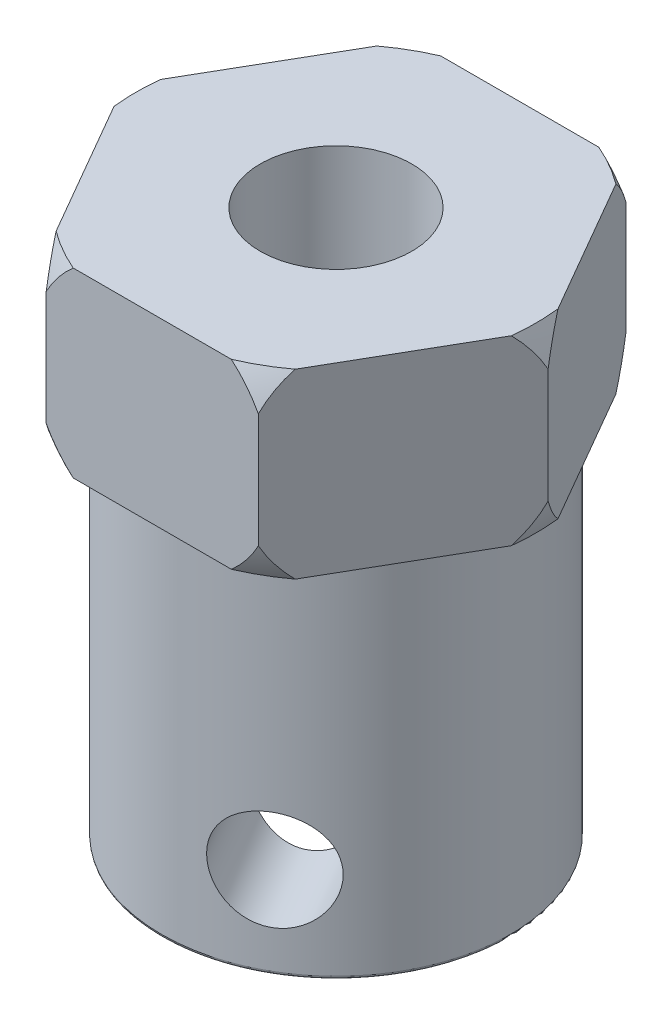
ISO-10303-21;
HEADER;
FILE_DESCRIPTION(('STEP AP214'),'2;1');
FILE_NAME('part.step','',(''),(''),'','','');
FILE_SCHEMA(('AUTOMOTIVE_DESIGN { 1 0 10303 214 1 1 1 1 }'));
ENDSEC;
DATA;
#1=APPLICATION_CONTEXT('core data for automotive mechanical design processes');
#2=APPLICATION_PROTOCOL_DEFINITION('international standard','automotive_design',2000,#1);
#3=PRODUCT_CONTEXT('',#1,'mechanical');
#4=PRODUCT('Part','Part','',(#3));
#5=PRODUCT_RELATED_PRODUCT_CATEGORY('part','',(#4));
#6=PRODUCT_DEFINITION_FORMATION('','',#4);
#7=PRODUCT_DEFINITION_CONTEXT('part definition',#1,'design');
#8=PRODUCT_DEFINITION('design','',#6,#7);
#9=PRODUCT_DEFINITION_SHAPE('','',#8);
#10=(LENGTH_UNIT() NAMED_UNIT(*) SI_UNIT(.MILLI.,.METRE.));
#11=(NAMED_UNIT(*) PLANE_ANGLE_UNIT() SI_UNIT($,.RADIAN.));
#12=(NAMED_UNIT(*) SI_UNIT($,.STERADIAN.) SOLID_ANGLE_UNIT());
#13=UNCERTAINTY_MEASURE_WITH_UNIT(LENGTH_MEASURE(1.E-05),#10,'distance_accuracy_value','');
#14=(GEOMETRIC_REPRESENTATION_CONTEXT(3) GLOBAL_UNCERTAINTY_ASSIGNED_CONTEXT((#13)) GLOBAL_UNIT_ASSIGNED_CONTEXT((#10,
#11,#12)) REPRESENTATION_CONTEXT('',''));
#15=CARTESIAN_POINT('',(0.,0.,0.));
#16=DIRECTION('',(0.,0.,1.));
#17=DIRECTION('',(1.,0.,0.));
#18=AXIS2_PLACEMENT_3D('',#15,#16,#17);
#19=CARTESIAN_POINT('',(-7.,6.,0.));
#20=DIRECTION('',(0.866025403784439,0.,-0.5));
#21=DIRECTION('',(-0.5,0.,-0.866025403784439));
#22=AXIS2_PLACEMENT_3D('',#19,#20,#21);
#23=PLANE('',#22);
#24=CARTESIAN_POINT('',(-5.25,3.,3.03108891324554));
#25=DIRECTION('',(0.866025403784439,0.,-0.5));
#26=DIRECTION('',(-0.5,0.,-0.866025403784439));
#27=AXIS2_PLACEMENT_3D('',#24,#25,#26);
#28=CIRCLE('',#27,3.97649343014671);
#29=CARTESIAN_POINT('',(-3.5,1.11254139118233,6.06217782649107));
#30=VERTEX_POINT('',#29);
#31=CARTESIAN_POINT('',(-3.94496168638619,0.,5.29148157824867));
#32=VERTEX_POINT('',#31);
#33=EDGE_CURVE('E315',#30,#32,#28,.T.);
#34=ORIENTED_EDGE('',*,*,#33,.F.);
#35=DIRECTION('',(0.,-1.,0.));
#36=VECTOR('',#35,1.);
#37=CARTESIAN_POINT('',(-3.5,6.,6.06217782649107));
#38=LINE('',#37,#36);
#39=CARTESIAN_POINT('',(-3.5,4.88745860881767,6.06217782649107));
#40=VERTEX_POINT('',#39);
#41=EDGE_CURVE('E201',#40,#30,#38,.T.);
#42=ORIENTED_EDGE('',*,*,#41,.F.);
#43=CARTESIAN_POINT('',(-5.25,3.,3.03108891324554));
#44=DIRECTION('',(0.866025403784439,0.,-0.5));
#45=DIRECTION('',(-0.5,0.,-0.866025403784439));
#46=AXIS2_PLACEMENT_3D('',#43,#44,#45);
#47=CIRCLE('',#46,3.97649343014671);
#48=CARTESIAN_POINT('',(-3.94496168638619,6.,5.29148157824867));
#49=VERTEX_POINT('',#48);
#50=EDGE_CURVE('E325',#49,#40,#47,.T.);
#51=ORIENTED_EDGE('',*,*,#50,.F.);
#52=DIRECTION('',(0.5,0.,0.866025403784439));
#53=VECTOR('',#52,1.);
#54=CARTESIAN_POINT('',(-7.,6.,0.));
#55=LINE('',#54,#53);
#56=CARTESIAN_POINT('',(-6.55503831361382,6.,0.770696248242404));
#57=VERTEX_POINT('',#56);
#58=EDGE_CURVE('E337',#57,#49,#55,.T.);
#59=ORIENTED_EDGE('',*,*,#58,.F.);
#60=CARTESIAN_POINT('',(-7.,4.88745860881767,0.));
#61=VERTEX_POINT('',#60);
#62=EDGE_CURVE('E370',#61,#57,#47,.T.);
#63=ORIENTED_EDGE('',*,*,#62,.F.);
#64=DIRECTION('',(0.,-1.,0.));
#65=VECTOR('',#64,1.);
#66=CARTESIAN_POINT('',(-7.,6.,0.));
#67=LINE('',#66,#65);
#68=CARTESIAN_POINT('',(-7.,1.11254139118233,0.));
#69=VERTEX_POINT('',#68);
#70=EDGE_CURVE('E195',#61,#69,#67,.T.);
#71=ORIENTED_EDGE('',*,*,#70,.T.);
#72=CARTESIAN_POINT('',(-6.55503831361382,0.,0.770696248242403));
#73=VERTEX_POINT('',#72);
#74=EDGE_CURVE('E169',#73,#69,#28,.T.);
#75=ORIENTED_EDGE('',*,*,#74,.F.);
#76=DIRECTION('',(0.5,0.,0.866025403784439));
#77=VECTOR('',#76,1.);
#78=CARTESIAN_POINT('',(-7.,0.,0.));
#79=LINE('',#78,#77);
#80=EDGE_CURVE('E311',#73,#32,#79,.T.);
#81=ORIENTED_EDGE('',*,*,#80,.T.);
#82=EDGE_LOOP('',(#34,#42,#51,#59,#63,#71,#75,#81));
#83=FACE_BOUND('',#82,.T.);
#84=ADVANCED_FACE('F35',(#83),#23,.F.);
#85=CARTESIAN_POINT('',(-3.5,6.,6.06217782649107));
#86=DIRECTION('',(0.,0.,-1.));
#87=DIRECTION('',(-1.,0.,0.));
#88=AXIS2_PLACEMENT_3D('',#85,#86,#87);
#89=PLANE('',#88);
#90=CARTESIAN_POINT('',(0.,3.,6.06217782649107));
#91=DIRECTION('',(0.,0.,-1.));
#92=DIRECTION('',(-1.,0.,0.));
#93=AXIS2_PLACEMENT_3D('',#90,#91,#92);
#94=CIRCLE('',#93,3.97649343014671);
#95=CARTESIAN_POINT('',(3.5,1.11254139118233,6.06217782649108));
#96=VERTEX_POINT('',#95);
#97=CARTESIAN_POINT('',(2.61007662722764,0.,6.06217782649107));
#98=VERTEX_POINT('',#97);
#99=EDGE_CURVE('E50',#96,#98,#94,.T.);
#100=ORIENTED_EDGE('',*,*,#99,.F.);
#101=DIRECTION('',(0.,-1.,0.));
#102=VECTOR('',#101,1.);
#103=CARTESIAN_POINT('',(3.50000000000001,6.,6.06217782649107));
#104=LINE('',#103,#102);
#105=CARTESIAN_POINT('',(3.5,4.88745860881767,6.06217782649107));
#106=VERTEX_POINT('',#105);
#107=EDGE_CURVE('E192',#106,#96,#104,.T.);
#108=ORIENTED_EDGE('',*,*,#107,.F.);
#109=CARTESIAN_POINT('',(0.,3.,6.06217782649107));
#110=DIRECTION('',(0.,0.,-1.));
#111=DIRECTION('',(-1.,0.,0.));
#112=AXIS2_PLACEMENT_3D('',#109,#110,#111);
#113=CIRCLE('',#112,3.97649343014671);
#114=CARTESIAN_POINT('',(2.61007662722764,6.,6.06217782649107));
#115=VERTEX_POINT('',#114);
#116=EDGE_CURVE('E358',#115,#106,#113,.T.);
#117=ORIENTED_EDGE('',*,*,#116,.F.);
#118=DIRECTION('',(1.,0.,0.));
#119=VECTOR('',#118,1.);
#120=CARTESIAN_POINT('',(-3.5,6.,6.06217782649107));
#121=LINE('',#120,#119);
#122=CARTESIAN_POINT('',(-2.61007662722763,6.,6.06217782649107));
#123=VERTEX_POINT('',#122);
#124=EDGE_CURVE('E353',#123,#115,#121,.T.);
#125=ORIENTED_EDGE('',*,*,#124,.F.);
#126=EDGE_CURVE('E360',#40,#123,#113,.T.);
#127=ORIENTED_EDGE('',*,*,#126,.F.);
#128=ORIENTED_EDGE('',*,*,#41,.T.);
#129=CARTESIAN_POINT('',(-2.61007662722763,0.,6.06217782649107));
#130=VERTEX_POINT('',#129);
#131=EDGE_CURVE('E377',#130,#30,#94,.T.);
#132=ORIENTED_EDGE('',*,*,#131,.F.);
#133=DIRECTION('',(1.,0.,0.));
#134=VECTOR('',#133,1.);
#135=CARTESIAN_POINT('',(-3.5,0.,6.06217782649107));
#136=LINE('',#135,#134);
#137=EDGE_CURVE('E318',#130,#98,#136,.T.);
#138=ORIENTED_EDGE('',*,*,#137,.T.);
#139=EDGE_LOOP('',(#100,#108,#117,#125,#127,#128,#132,#138));
#140=FACE_BOUND('',#139,.T.);
#141=ADVANCED_FACE('F271',(#140),#89,.F.);
#142=CARTESIAN_POINT('',(3.50000000000001,6.,6.06217782649107));
#143=DIRECTION('',(-0.866025403784439,0.,-0.5));
#144=DIRECTION('',(-0.5,0.,0.866025403784439));
#145=AXIS2_PLACEMENT_3D('',#142,#143,#144);
#146=PLANE('',#145);
#147=CARTESIAN_POINT('',(5.25,3.,3.03108891324554));
#148=DIRECTION('',(-0.866025403784439,0.,-0.5));
#149=DIRECTION('',(-0.5,0.,0.866025403784439));
#150=AXIS2_PLACEMENT_3D('',#147,#148,#149);
#151=CIRCLE('',#150,3.97649343014671);
#152=CARTESIAN_POINT('',(7.,1.11254139118233,0.));
#153=VERTEX_POINT('',#152);
#154=CARTESIAN_POINT('',(6.55503831361382,0.,0.770696248242403));
#155=VERTEX_POINT('',#154);
#156=EDGE_CURVE('E58',#153,#155,#151,.T.);
#157=ORIENTED_EDGE('',*,*,#156,.F.);
#158=DIRECTION('',(0.,-1.,0.));
#159=VECTOR('',#158,1.);
#160=CARTESIAN_POINT('',(7.,6.,0.));
#161=LINE('',#160,#159);
#162=CARTESIAN_POINT('',(7.,4.88745860881767,0.));
#163=VERTEX_POINT('',#162);
#164=EDGE_CURVE('E188',#163,#153,#161,.T.);
#165=ORIENTED_EDGE('',*,*,#164,.F.);
#166=CARTESIAN_POINT('',(5.25,3.,3.03108891324554));
#167=DIRECTION('',(-0.866025403784439,0.,-0.5));
#168=DIRECTION('',(-0.5,0.,0.866025403784439));
#169=AXIS2_PLACEMENT_3D('',#166,#167,#168);
#170=CIRCLE('',#169,3.97649343014671);
#171=CARTESIAN_POINT('',(6.55503831361382,6.,0.770696248242403));
#172=VERTEX_POINT('',#171);
#173=EDGE_CURVE('E362',#172,#163,#170,.T.);
#174=ORIENTED_EDGE('',*,*,#173,.F.);
#175=DIRECTION('',(0.5,0.,-0.866025403784439));
#176=VECTOR('',#175,1.);
#177=CARTESIAN_POINT('',(3.50000000000001,6.,6.06217782649107));
#178=LINE('',#177,#176);
#179=CARTESIAN_POINT('',(3.94496168638619,6.,5.29148157824867));
#180=VERTEX_POINT('',#179);
#181=EDGE_CURVE('E348',#180,#172,#178,.T.);
#182=ORIENTED_EDGE('',*,*,#181,.F.);
#183=EDGE_CURVE('E361',#106,#180,#170,.T.);
#184=ORIENTED_EDGE('',*,*,#183,.F.);
#185=ORIENTED_EDGE('',*,*,#107,.T.);
#186=CARTESIAN_POINT('',(3.94496168638619,0.,5.29148157824867));
#187=VERTEX_POINT('',#186);
#188=EDGE_CURVE('E378',#187,#96,#151,.T.);
#189=ORIENTED_EDGE('',*,*,#188,.F.);
#190=DIRECTION('',(0.5,0.,-0.866025403784439));
#191=VECTOR('',#190,1.);
#192=CARTESIAN_POINT('',(3.50000000000001,0.,6.06217782649107));
#193=LINE('',#192,#191);
#194=EDGE_CURVE('E322',#187,#155,#193,.T.);
#195=ORIENTED_EDGE('',*,*,#194,.T.);
#196=EDGE_LOOP('',(#157,#165,#174,#182,#184,#185,#189,#195));
#197=FACE_BOUND('',#196,.T.);
#198=ADVANCED_FACE('F268',(#197),#146,.F.);
#199=CARTESIAN_POINT('',(7.,6.,0.));
#200=DIRECTION('',(-0.866025403784439,0.,0.5));
#201=DIRECTION('',(0.5,0.,0.866025403784439));
#202=AXIS2_PLACEMENT_3D('',#199,#200,#201);
#203=PLANE('',#202);
#204=CARTESIAN_POINT('',(5.25,3.,-3.03108891324554));
#205=DIRECTION('',(-0.866025403784439,0.,0.5));
#206=DIRECTION('',(0.5,0.,0.866025403784439));
#207=AXIS2_PLACEMENT_3D('',#204,#205,#206);
#208=CIRCLE('',#207,3.97649343014671);
#209=CARTESIAN_POINT('',(3.5,1.11254139118233,-6.06217782649107));
#210=VERTEX_POINT('',#209);
#211=CARTESIAN_POINT('',(3.94496168638619,0.,-5.29148157824867));
#212=VERTEX_POINT('',#211);
#213=EDGE_CURVE('E162',#210,#212,#208,.T.);
#214=ORIENTED_EDGE('',*,*,#213,.F.);
#215=DIRECTION('',(0.,-1.,0.));
#216=VECTOR('',#215,1.);
#217=CARTESIAN_POINT('',(3.5,6.,-6.06217782649107));
#218=LINE('',#217,#216);
#219=CARTESIAN_POINT('',(3.5,4.88745860881767,-6.06217782649107));
#220=VERTEX_POINT('',#219);
#221=EDGE_CURVE('E177',#220,#210,#218,.T.);
#222=ORIENTED_EDGE('',*,*,#221,.F.);
#223=CARTESIAN_POINT('',(5.25,3.,-3.03108891324554));
#224=DIRECTION('',(-0.866025403784439,0.,0.5));
#225=DIRECTION('',(0.5,0.,0.866025403784439));
#226=AXIS2_PLACEMENT_3D('',#223,#224,#225);
#227=CIRCLE('',#226,3.97649343014671);
#228=CARTESIAN_POINT('',(3.94496168638619,6.,-5.29148157824867));
#229=VERTEX_POINT('',#228);
#230=EDGE_CURVE('E365',#229,#220,#227,.T.);
#231=ORIENTED_EDGE('',*,*,#230,.F.);
#232=DIRECTION('',(-0.5,0.,-0.866025403784439));
#233=VECTOR('',#232,1.);
#234=CARTESIAN_POINT('',(7.,6.,0.));
#235=LINE('',#234,#233);
#236=CARTESIAN_POINT('',(6.55503831361382,6.,-0.770696248242403));
#237=VERTEX_POINT('',#236);
#238=EDGE_CURVE('E345',#237,#229,#235,.T.);
#239=ORIENTED_EDGE('',*,*,#238,.F.);
#240=EDGE_CURVE('E364',#163,#237,#227,.T.);
#241=ORIENTED_EDGE('',*,*,#240,.F.);
#242=ORIENTED_EDGE('',*,*,#164,.T.);
#243=CARTESIAN_POINT('',(6.55503831361382,0.,-0.770696248242403));
#244=VERTEX_POINT('',#243);
#245=EDGE_CURVE('E181',#244,#153,#208,.T.);
#246=ORIENTED_EDGE('',*,*,#245,.F.);
#247=DIRECTION('',(-0.5,0.,-0.866025403784439));
#248=VECTOR('',#247,1.);
#249=CARTESIAN_POINT('',(7.,0.,0.));
#250=LINE('',#249,#248);
#251=EDGE_CURVE('E180',#244,#212,#250,.T.);
#252=ORIENTED_EDGE('',*,*,#251,.T.);
#253=EDGE_LOOP('',(#214,#222,#231,#239,#241,#242,#246,#252));
#254=FACE_BOUND('',#253,.T.);
#255=ADVANCED_FACE('F175',(#254),#203,.F.);
#256=CARTESIAN_POINT('',(3.5,6.,-6.06217782649107));
#257=DIRECTION('',(0.,0.,1.));
#258=DIRECTION('',(1.,0.,0.));
#259=AXIS2_PLACEMENT_3D('',#256,#257,#258);
#260=PLANE('',#259);
#261=CARTESIAN_POINT('',(0.,3.,-6.06217782649107));
#262=DIRECTION('',(0.,0.,1.));
#263=DIRECTION('',(1.,0.,0.));
#264=AXIS2_PLACEMENT_3D('',#261,#262,#263);
#265=CIRCLE('',#264,3.97649343014671);
#266=CARTESIAN_POINT('',(-3.5,1.11254139118233,-6.06217782649108));
#267=VERTEX_POINT('',#266);
#268=CARTESIAN_POINT('',(-2.61007662722763,0.,-6.06217782649107));
#269=VERTEX_POINT('',#268);
#270=EDGE_CURVE('E171',#267,#269,#265,.T.);
#271=ORIENTED_EDGE('',*,*,#270,.F.);
#272=DIRECTION('',(0.,-1.,0.));
#273=VECTOR('',#272,1.);
#274=CARTESIAN_POINT('',(-3.5,6.,-6.06217782649107));
#275=LINE('',#274,#273);
#276=CARTESIAN_POINT('',(-3.5,4.88745860881767,-6.06217782649108));
#277=VERTEX_POINT('',#276);
#278=EDGE_CURVE('E189',#277,#267,#275,.T.);
#279=ORIENTED_EDGE('',*,*,#278,.F.);
#280=CARTESIAN_POINT('',(0.,3.,-6.06217782649107));
#281=DIRECTION('',(0.,0.,1.));
#282=DIRECTION('',(1.,0.,0.));
#283=AXIS2_PLACEMENT_3D('',#280,#281,#282);
#284=CIRCLE('',#283,3.97649343014671);
#285=CARTESIAN_POINT('',(-2.61007662722763,6.,-6.06217782649107));
#286=VERTEX_POINT('',#285);
#287=EDGE_CURVE('E367',#286,#277,#284,.T.);
#288=ORIENTED_EDGE('',*,*,#287,.F.);
#289=DIRECTION('',(-1.,0.,0.));
#290=VECTOR('',#289,1.);
#291=CARTESIAN_POINT('',(3.5,6.,-6.06217782649107));
#292=LINE('',#291,#290);
#293=CARTESIAN_POINT('',(2.61007662722763,6.,-6.06217782649107));
#294=VERTEX_POINT('',#293);
#295=EDGE_CURVE('E339',#294,#286,#292,.T.);
#296=ORIENTED_EDGE('',*,*,#295,.F.);
#297=EDGE_CURVE('E187',#220,#294,#284,.T.);
#298=ORIENTED_EDGE('',*,*,#297,.F.);
#299=ORIENTED_EDGE('',*,*,#221,.T.);
#300=CARTESIAN_POINT('',(2.61007662722763,0.,-6.06217782649107));
#301=VERTEX_POINT('',#300);
#302=EDGE_CURVE('E159',#301,#210,#265,.T.);
#303=ORIENTED_EDGE('',*,*,#302,.F.);
#304=DIRECTION('',(-1.,0.,0.));
#305=VECTOR('',#304,1.);
#306=CARTESIAN_POINT('',(3.5,0.,-6.06217782649107));
#307=LINE('',#306,#305);
#308=EDGE_CURVE('E334',#301,#269,#307,.T.);
#309=ORIENTED_EDGE('',*,*,#308,.T.);
#310=EDGE_LOOP('',(#271,#279,#288,#296,#298,#299,#303,#309));
#311=FACE_BOUND('',#310,.T.);
#312=ADVANCED_FACE('F185',(#311),#260,.F.);
#313=CARTESIAN_POINT('',(-3.5,6.,-6.06217782649107));
#314=DIRECTION('',(0.866025403784439,0.,0.5));
#315=DIRECTION('',(0.5,0.,-0.866025403784439));
#316=AXIS2_PLACEMENT_3D('',#313,#314,#315);
#317=PLANE('',#316);
#318=CARTESIAN_POINT('',(-5.25,3.,-3.03108891324554));
#319=DIRECTION('',(0.866025403784439,0.,0.5));
#320=DIRECTION('',(0.5,0.,-0.866025403784439));
#321=AXIS2_PLACEMENT_3D('',#318,#319,#320);
#322=CIRCLE('',#321,3.97649343014671);
#323=CARTESIAN_POINT('',(-6.55503831361382,0.,-0.770696248242404));
#324=VERTEX_POINT('',#323);
#325=EDGE_CURVE('E303',#69,#324,#322,.T.);
#326=ORIENTED_EDGE('',*,*,#325,.F.);
#327=ORIENTED_EDGE('',*,*,#70,.F.);
#328=CARTESIAN_POINT('',(-5.25,3.,-3.03108891324554));
#329=DIRECTION('',(0.866025403784439,0.,0.5));
#330=DIRECTION('',(0.5,0.,-0.866025403784439));
#331=AXIS2_PLACEMENT_3D('',#328,#329,#330);
#332=CIRCLE('',#331,3.97649343014671);
#333=CARTESIAN_POINT('',(-6.55503831361382,6.,-0.770696248242403));
#334=VERTEX_POINT('',#333);
#335=EDGE_CURVE('E372',#334,#61,#332,.T.);
#336=ORIENTED_EDGE('',*,*,#335,.F.);
#337=DIRECTION('',(-0.5,0.,0.866025403784439));
#338=VECTOR('',#337,1.);
#339=CARTESIAN_POINT('',(-3.5,6.,-6.06217782649107));
#340=LINE('',#339,#338);
#341=CARTESIAN_POINT('',(-3.94496168638619,6.,-5.29148157824867));
#342=VERTEX_POINT('',#341);
#343=EDGE_CURVE('E328',#342,#334,#340,.T.);
#344=ORIENTED_EDGE('',*,*,#343,.F.);
#345=EDGE_CURVE('E369',#277,#342,#332,.T.);
#346=ORIENTED_EDGE('',*,*,#345,.F.);
#347=ORIENTED_EDGE('',*,*,#278,.T.);
#348=CARTESIAN_POINT('',(-3.94496168638619,0.,-5.29148157824867));
#349=VERTEX_POINT('',#348);
#350=EDGE_CURVE('E379',#349,#267,#322,.T.);
#351=ORIENTED_EDGE('',*,*,#350,.F.);
#352=DIRECTION('',(-0.5,0.,0.866025403784439));
#353=VECTOR('',#352,1.);
#354=CARTESIAN_POINT('',(-3.5,0.,-6.06217782649107));
#355=LINE('',#354,#353);
#356=EDGE_CURVE('E336',#349,#324,#355,.T.);
#357=ORIENTED_EDGE('',*,*,#356,.T.);
#358=EDGE_LOOP('',(#326,#327,#336,#344,#346,#347,#351,#357));
#359=FACE_BOUND('',#358,.T.);
#360=ADVANCED_FACE('F259',(#359),#317,.F.);
#361=CARTESIAN_POINT('',(0.,0.,0.));
#362=DIRECTION('',(0.,1.,0.));
#363=DIRECTION('',(0.,0.,1.));
#364=AXIS2_PLACEMENT_3D('',#361,#362,#363);
#365=PLANE('',#364);
#366=CARTESIAN_POINT('',(0.,0.,0.));
#367=DIRECTION('',(0.,1.,0.));
#368=DIRECTION('',(0.,0.,1.));
#369=AXIS2_PLACEMENT_3D('',#366,#367,#368);
#370=CIRCLE('',#369,5.75);
#371=CARTESIAN_POINT('',(0.,0.,5.75));
#372=VERTEX_POINT('',#371);
#373=EDGE_CURVE('E204',#372,#372,#370,.F.);
#374=ORIENTED_EDGE('',*,*,#373,.F.);
#375=EDGE_LOOP('',(#374));
#376=FACE_BOUND('',#375,.T.);
#377=CARTESIAN_POINT('',(0.,0.,0.));
#378=DIRECTION('',(0.,1.,0.));
#379=DIRECTION('',(0.,0.,1.));
#380=AXIS2_PLACEMENT_3D('',#377,#378,#379);
#381=CIRCLE('',#380,6.60018939122204);
#382=EDGE_CURVE('E215',#98,#187,#381,.T.);
#383=ORIENTED_EDGE('',*,*,#382,.F.);
#384=ORIENTED_EDGE('',*,*,#137,.F.);
#385=EDGE_CURVE('E212',#32,#130,#381,.T.);
#386=ORIENTED_EDGE('',*,*,#385,.F.);
#387=ORIENTED_EDGE('',*,*,#80,.F.);
#388=EDGE_CURVE('E214',#324,#73,#381,.T.);
#389=ORIENTED_EDGE('',*,*,#388,.F.);
#390=ORIENTED_EDGE('',*,*,#356,.F.);
#391=EDGE_CURVE('E294',#269,#349,#381,.T.);
#392=ORIENTED_EDGE('',*,*,#391,.F.);
#393=ORIENTED_EDGE('',*,*,#308,.F.);
#394=CARTESIAN_POINT('',(0.,0.,0.));
#395=DIRECTION('',(0.,-1.,0.));
#396=DIRECTION('',(0.,0.,-1.));
#397=AXIS2_PLACEMENT_3D('',#394,#395,#396);
#398=CIRCLE('',#397,6.60018939122204);
#399=EDGE_CURVE('E164',#301,#212,#398,.T.);
#400=ORIENTED_EDGE('',*,*,#399,.T.);
#401=ORIENTED_EDGE('',*,*,#251,.F.);
#402=EDGE_CURVE('E292',#155,#244,#381,.T.);
#403=ORIENTED_EDGE('',*,*,#402,.F.);
#404=ORIENTED_EDGE('',*,*,#194,.F.);
#405=EDGE_LOOP('',(#383,#384,#386,#387,#389,#390,#392,#393,#400,#401,#403,#404));
#406=FACE_BOUND('',#405,.T.);
#407=ADVANCED_FACE('F255',(#376,#406),#365,.F.);
#408=CARTESIAN_POINT('',(0.,6.,0.));
#409=DIRECTION('',(0.,1.,0.));
#410=DIRECTION('',(0.,0.,1.));
#411=AXIS2_PLACEMENT_3D('',#408,#409,#410);
#412=PLANE('',#411);
#413=CARTESIAN_POINT('',(0.,6.,0.));
#414=DIRECTION('',(0.,1.,0.));
#415=DIRECTION('',(0.,0.,1.));
#416=AXIS2_PLACEMENT_3D('',#413,#414,#415);
#417=CIRCLE('',#416,2.5);
#418=CARTESIAN_POINT('',(0.,6.,2.5));
#419=VERTEX_POINT('',#418);
#420=EDGE_CURVE('E319',#419,#419,#417,.T.);
#421=ORIENTED_EDGE('',*,*,#420,.F.);
#422=EDGE_LOOP('',(#421));
#423=FACE_BOUND('',#422,.T.);
#424=ORIENTED_EDGE('',*,*,#124,.T.);
#425=CARTESIAN_POINT('',(0.,6.,0.));
#426=DIRECTION('',(0.,1.,0.));
#427=DIRECTION('',(0.,0.,1.));
#428=AXIS2_PLACEMENT_3D('',#425,#426,#427);
#429=CIRCLE('',#428,6.60018939122204);
#430=EDGE_CURVE('E211',#115,#180,#429,.T.);
#431=ORIENTED_EDGE('',*,*,#430,.T.);
#432=ORIENTED_EDGE('',*,*,#181,.T.);
#433=EDGE_CURVE('E387',#172,#237,#429,.T.);
#434=ORIENTED_EDGE('',*,*,#433,.T.);
#435=ORIENTED_EDGE('',*,*,#238,.T.);
#436=CARTESIAN_POINT('',(0.,6.,0.));
#437=DIRECTION('',(0.,-1.,0.));
#438=DIRECTION('',(0.,0.,-1.));
#439=AXIS2_PLACEMENT_3D('',#436,#437,#438);
#440=CIRCLE('',#439,6.60018939122204);
#441=EDGE_CURVE('E374',#294,#229,#440,.T.);
#442=ORIENTED_EDGE('',*,*,#441,.F.);
#443=ORIENTED_EDGE('',*,*,#295,.T.);
#444=EDGE_CURVE('E386',#286,#342,#429,.T.);
#445=ORIENTED_EDGE('',*,*,#444,.T.);
#446=ORIENTED_EDGE('',*,*,#343,.T.);
#447=EDGE_CURVE('E210',#334,#57,#429,.T.);
#448=ORIENTED_EDGE('',*,*,#447,.T.);
#449=ORIENTED_EDGE('',*,*,#58,.T.);
#450=EDGE_CURVE('E207',#49,#123,#429,.T.);
#451=ORIENTED_EDGE('',*,*,#450,.T.);
#452=EDGE_LOOP('',(#424,#431,#432,#434,#435,#442,#443,#445,#446,#448,#449,#451));
#453=FACE_BOUND('',#452,.T.);
#454=ADVANCED_FACE('F251',(#423,#453),#412,.T.);
#455=CARTESIAN_POINT('',(0.,-12.,0.));
#456=DIRECTION('',(0.,1.,0.));
#457=DIRECTION('',(0.,0.,1.));
#458=AXIS2_PLACEMENT_3D('',#455,#456,#457);
#459=CYLINDRICAL_SURFACE('',#458,5.75);
#460=CARTESIAN_POINT('',(0.,-11.9,0.));
#461=DIRECTION('',(0.,-1.,0.));
#462=DIRECTION('',(0.,0.,-1.));
#463=AXIS2_PLACEMENT_3D('',#460,#461,#462);
#464=CIRCLE('',#463,5.75);
#465=CARTESIAN_POINT('',(0.,-11.9,-5.75));
#466=VERTEX_POINT('',#465);
#467=EDGE_CURVE('E11',#466,#466,#464,.F.);
#468=ORIENTED_EDGE('',*,*,#467,.T.);
#469=EDGE_LOOP('',(#468));
#470=FACE_BOUND('',#469,.T.);
#471=CARTESIAN_POINT('',(4.1830297870284,-9.,3.94522012070722));
#472=CARTESIAN_POINT('',(4.18302902979221,-9.0906093893702,3.94522199358663));
#473=CARTESIAN_POINT('',(4.17767415738663,-9.181234830955,3.95092210099207));
#474=CARTESIAN_POINT('',(4.15634736019109,-9.35984921692238,3.97334981121673));
#475=CARTESIAN_POINT('',(4.14037118358543,-9.44783709071233,3.99008183019975));
#476=CARTESIAN_POINT('',(4.0981014623425,-9.61856571561707,4.03348149839735));
#477=CARTESIAN_POINT('',(4.0718239927805,-9.7013144098624,4.06013366405282));
#478=CARTESIAN_POINT('',(4.00933560633132,-9.85960127988848,4.12185017443212));
#479=CARTESIAN_POINT('',(3.97312348327512,-9.93513857862965,4.15691554054004));
#480=CARTESIAN_POINT('',(3.89016397705033,-10.079045453728,4.23467024857033));
#481=CARTESIAN_POINT('',(3.84316538578946,-10.1471753301857,4.27753529634245));
#482=CARTESIAN_POINT('',(3.73984665202711,-10.2722049573473,4.36815313393681));
#483=CARTESIAN_POINT('',(3.68352541063915,-10.3291033824334,4.41590649970507));
#484=CARTESIAN_POINT('',(3.56129216379783,-10.4310790655768,4.51508561100235));
#485=CARTESIAN_POINT('',(3.49521997785839,-10.475914385796,4.56656346411527));
#486=CARTESIAN_POINT('',(3.35561954375189,-10.5509070194395,4.67010248502626));
#487=CARTESIAN_POINT('',(3.2820927639008,-10.5810672166317,4.72216353616302));
#488=CARTESIAN_POINT('',(3.13139543351043,-10.625067298141,4.82336814710696));
#489=CARTESIAN_POINT('',(3.05437168886701,-10.6393157746184,4.87255242960377));
#490=CARTESIAN_POINT('',(2.8970889590021,-10.6523773093682,4.96767704736507));
#491=CARTESIAN_POINT('',(2.81683060037645,-10.6511933429572,5.01361800621291));
#492=CARTESIAN_POINT('',(2.65788483513904,-10.633703321213,5.09961577816207));
#493=CARTESIAN_POINT('',(2.57921987867996,-10.6178393059029,5.13980512453581));
#494=CARTESIAN_POINT('',(2.42350419065765,-10.5721583599925,5.21503682923325));
#495=CARTESIAN_POINT('',(2.34645355798348,-10.5423405772182,5.25007887303305));
#496=CARTESIAN_POINT('',(2.1954703847721,-10.4692834889101,5.31500171592103));
#497=CARTESIAN_POINT('',(2.12158145386505,-10.4259001877578,5.34482151664867));
#498=CARTESIAN_POINT('',(1.98009056250129,-10.3270560037656,5.39884111184846));
#499=CARTESIAN_POINT('',(1.91248999437882,-10.2715924552253,5.42303966346234));
#500=CARTESIAN_POINT('',(1.78344966293903,-10.1478472667621,5.46686557372504));
#501=CARTESIAN_POINT('',(1.72231259347782,-10.0791814628661,5.48630085233711));
#502=CARTESIAN_POINT('',(1.61123448411057,-9.93217788501354,5.51994573240219));
#503=CARTESIAN_POINT('',(1.56129436916201,-9.85383931283771,5.53415490219911));
#504=CARTESIAN_POINT('',(1.47424405584893,-9.68883889667134,5.55798225685307));
#505=CARTESIAN_POINT('',(1.43724125584362,-9.60211467083054,5.56756225196152));
#506=CARTESIAN_POINT('',(1.378344532845,-9.42333553271446,5.58243670275366));
#507=CARTESIAN_POINT('',(1.35644616899102,-9.33128219588806,5.5877324181392));
#508=CARTESIAN_POINT('',(1.32933376182272,-9.14784327903692,5.59424353882479));
#509=CARTESIAN_POINT('',(1.32357297717407,-9.05654318123053,5.59559272528974));
#510=CARTESIAN_POINT('',(1.32745515460691,-8.87429731227064,5.59467312697458));
#511=CARTESIAN_POINT('',(1.33709617563354,-8.78335149791556,5.59240479810183));
#512=CARTESIAN_POINT('',(1.37089593763857,-8.60657906457413,5.58421272490119));
#513=CARTESIAN_POINT('',(1.39471336582109,-8.52068267243749,5.57837483435309));
#514=CARTESIAN_POINT('',(1.45551657755389,-8.35406215851399,5.56281851636145));
#515=CARTESIAN_POINT('',(1.49250427287037,-8.27333878963985,5.55309952552128));
#516=CARTESIAN_POINT('',(1.57924232204927,-8.11713244371055,5.52906514139279));
#517=CARTESIAN_POINT('',(1.62928780172632,-8.04183022933503,5.514641222497));
#518=CARTESIAN_POINT('',(1.7398087690269,-7.90057974017005,5.48077547242965));
#519=CARTESIAN_POINT('',(1.80028653709218,-7.83463351630566,5.46133254366738));
#520=CARTESIAN_POINT('',(1.93185315008244,-7.71165238525739,5.41621948591919));
#521=CARTESIAN_POINT('',(2.00323354601408,-7.65499811430147,5.39035958954769));
#522=CARTESIAN_POINT('',(2.15255344842063,-7.5550332816616,5.33248678906045));
#523=CARTESIAN_POINT('',(2.23049261282968,-7.51172202463483,5.30047420572013));
#524=CARTESIAN_POINT('',(2.38970899009361,-7.44008676441312,5.23061015067627));
#525=CARTESIAN_POINT('',(2.47095570324756,-7.41164937326773,5.19280578148281));
#526=CARTESIAN_POINT('',(2.63463771187431,-7.37026034468742,5.11170371128227));
#527=CARTESIAN_POINT('',(2.71707269306251,-7.3573046858842,5.06840744002612));
#528=CARTESIAN_POINT('',(2.87754520517646,-7.34753128450749,4.97899327610997));
#529=CARTESIAN_POINT('',(2.9556351618647,-7.35015913401303,4.93302927901491));
#530=CARTESIAN_POINT('',(3.10817477830524,-7.37016820623244,4.83836821621275));
#531=CARTESIAN_POINT('',(3.18262461485167,-7.38754871168193,4.78967128348668));
#532=CARTESIAN_POINT('',(3.3253251310195,-7.43623773109114,4.69170997575321));
#533=CARTESIAN_POINT('',(3.39362599534651,-7.46741824443485,4.64245477833982));
#534=CARTESIAN_POINT('',(3.52335315132487,-7.54270828489048,4.54478634662924));
#535=CARTESIAN_POINT('',(3.58477837057303,-7.5868198249992,4.49637324466657));
#536=CARTESIAN_POINT('',(3.70141472116752,-7.68825446854338,4.40089574605912));
#537=CARTESIAN_POINT('',(3.75638478211382,-7.74593354043807,4.35391510964854));
#538=CARTESIAN_POINT('',(3.85708914286321,-7.87221130196676,4.26496038539094));
#539=CARTESIAN_POINT('',(3.90282087394354,-7.94081301919304,4.22298769132944));
#540=CARTESIAN_POINT('',(3.9855058721924,-8.0891782239344,4.1450648750408));
#541=CARTESIAN_POINT('',(4.02219368024337,-8.16918980256157,4.10930435250117));
#542=CARTESIAN_POINT('',(4.08462093363673,-8.33677656820897,4.04726090699754));
#543=CARTESIAN_POINT('',(4.11036643497358,-8.42434753912731,4.02097274280811));
#544=CARTESIAN_POINT('',(4.14788852491883,-8.59278594048456,3.98222909384774));
#545=CARTESIAN_POINT('',(4.16104954356578,-8.6730369627738,3.96841619684086));
#546=CARTESIAN_POINT('',(4.17861981308018,-8.83552112920832,3.94991159524365));
#547=CARTESIAN_POINT('',(4.18303047437091,-8.91775395175472,3.94521842069654));
#548=CARTESIAN_POINT('',(4.1830297870284,-9.,3.94522012070722));
#549=B_SPLINE_CURVE_WITH_KNOTS('',3,(#471,#472,#473,#474,#475,#476,#477,#478,#479,#480,#481,
#482,#483,#484,#485,#486,#487,#488,#489,#490,#491,#492,#493,#494,#495,#496,#497,#498,#499,#500,
#501,#502,#503,#504,#505,#506,#507,#508,#509,#510,#511,#512,#513,#514,#515,#516,#517,#518,#519,
#520,#521,#522,#523,#524,#525,#526,#527,#528,#529,#530,#531,#532,#533,#534,#535,#536,#537,#538,
#539,#540,#541,#542,#543,#544,#545,#546,#547,#548),.UNSPECIFIED.,.T.,.F.,(4,2,2,2,2,2,2,2,2,2,2,
2,2,2,2,2,2,2,2,2,2,2,2,2,2,2,2,2,2,2,2,2,2,2,2,2,2,2,4),(0.,0.271525176553311,
0.543159112886907,0.814370843506789,1.08561551660087,1.36396811048117,1.64235353794388,
1.92596442909338,2.20951956611986,2.4856127873363,2.76165277961166,3.02964211600591,
3.29764782097701,3.56860089210499,3.83961381406143,4.12021779667902,4.40084495088292,
4.68374928887219,4.96657041456089,5.23968644726393,5.51276806248422,5.77952672988377,
6.04632413516485,6.3197713524974,6.59327841983462,6.87611365690189,7.15893415211754,
7.43956598651704,7.72012491115341,7.99076382429681,8.26138957990845,8.52955612826566,
8.79776444479337,9.07400180179034,9.3503158613379,9.63396986801826,9.91746668196836,
10.163969537289,10.4104326569043),.UNSPECIFIED.);
#550=CARTESIAN_POINT('',(4.1830297870284,-9.,3.94522012070722));
#551=VERTEX_POINT('',#550);
#552=EDGE_CURVE('E223',#551,#551,#549,.T.);
#553=ORIENTED_EDGE('',*,*,#552,.T.);
#554=EDGE_LOOP('',(#553));
#555=FACE_BOUND('',#554,.T.);
#556=ORIENTED_EDGE('',*,*,#373,.T.);
#557=EDGE_LOOP('',(#556));
#558=FACE_BOUND('',#557,.T.);
#559=ADVANCED_FACE('F246',(#470,#555,#558),#459,.T.);
#560=CARTESIAN_POINT('',(0.,-12.,0.));
#561=DIRECTION('',(0.,-1.,0.));
#562=DIRECTION('',(0.,0.,-1.));
#563=AXIS2_PLACEMENT_3D('',#560,#561,#562);
#564=PLANE('',#563);
#565=CARTESIAN_POINT('',(0.,-12.,0.));
#566=DIRECTION('',(0.,-1.,0.));
#567=DIRECTION('',(0.,0.,-1.));
#568=AXIS2_PLACEMENT_3D('',#565,#566,#567);
#569=CIRCLE('',#568,2.6);
#570=CARTESIAN_POINT('',(0.,-12.,-2.6));
#571=VERTEX_POINT('',#570);
#572=EDGE_CURVE('E43',#571,#571,#569,.F.);
#573=ORIENTED_EDGE('',*,*,#572,.T.);
#574=EDGE_LOOP('',(#573));
#575=FACE_BOUND('',#574,.T.);
#576=CARTESIAN_POINT('',(0.,-12.,0.));
#577=DIRECTION('',(0.,-1.,0.));
#578=DIRECTION('',(0.,0.,-1.));
#579=AXIS2_PLACEMENT_3D('',#576,#577,#578);
#580=CIRCLE('',#579,5.65);
#581=CARTESIAN_POINT('',(0.,-12.,-5.65));
#582=VERTEX_POINT('',#581);
#583=EDGE_CURVE('E290',#582,#582,#580,.T.);
#584=ORIENTED_EDGE('',*,*,#583,.T.);
#585=EDGE_LOOP('',(#584));
#586=FACE_BOUND('',#585,.T.);
#587=ADVANCED_FACE('F250',(#575,#586),#564,.T.);
#588=CARTESIAN_POINT('',(0.,-23.,0.));
#589=DIRECTION('',(0.,1.,0.));
#590=DIRECTION('',(0.,0.,1.));
#591=AXIS2_PLACEMENT_3D('',#588,#589,#590);
#592=CYLINDRICAL_SURFACE('',#591,2.5);
#593=CARTESIAN_POINT('',(0.,-11.9,0.));
#594=DIRECTION('',(0.,-1.,0.));
#595=DIRECTION('',(0.,0.,-1.));
#596=AXIS2_PLACEMENT_3D('',#593,#594,#595);
#597=CIRCLE('',#596,2.5);
#598=CARTESIAN_POINT('',(0.,-11.9,-2.5));
#599=VERTEX_POINT('',#598);
#600=EDGE_CURVE('E224',#599,#599,#597,.T.);
#601=ORIENTED_EDGE('',*,*,#600,.T.);
#602=EDGE_LOOP('',(#601));
#603=FACE_BOUND('',#602,.T.);
#604=CARTESIAN_POINT('',(0.,-10.0770329614269,2.5));
#605=CARTESIAN_POINT('',(0.0690047935305255,-10.1463898284737,2.50000042827924));
#606=CARTESIAN_POINT('',(0.14300046047085,-10.210781903631,2.4971314260674));
#607=CARTESIAN_POINT('',(0.298881559466851,-10.3285661505777,2.48330432786469));
#608=CARTESIAN_POINT('',(0.380781091193935,-10.3819381107707,2.47233153470179));
#609=CARTESIAN_POINT('',(0.550489552882493,-10.476090100952,2.44017650184251));
#610=CARTESIAN_POINT('',(0.638333693620302,-10.5167853147782,2.41892782374997));
#611=CARTESIAN_POINT('',(0.816136816277459,-10.5828828484272,2.36484847576682));
#612=CARTESIAN_POINT('',(0.906091669102315,-10.6083127987549,2.33203890331824));
#613=CARTESIAN_POINT('',(1.07315436508516,-10.6400325549132,2.25955408171473));
#614=CARTESIAN_POINT('',(1.15047390687667,-10.6483022601791,2.22123177416956));
#615=CARTESIAN_POINT('',(1.30088741041807,-10.6512228578827,2.13661490757525));
#616=CARTESIAN_POINT('',(1.37398285371372,-10.6458785552644,2.09032316664458));
#617=CARTESIAN_POINT('',(1.50672445294907,-10.6231146555655,1.99643474498246));
#618=CARTESIAN_POINT('',(1.56698737465676,-10.6069177152426,1.9494010409659));
#619=CARTESIAN_POINT('',(1.6809456551809,-10.5645365137108,1.8520369809404));
#620=CARTESIAN_POINT('',(1.73464025056228,-10.538351092997,1.80170624275989));
#621=CARTESIAN_POINT('',(1.83793880921985,-10.475165094447,1.69639296016706));
#622=CARTESIAN_POINT('',(1.88709898012688,-10.437606208417,1.64131317381229));
#623=CARTESIAN_POINT('',(1.97738855039355,-10.3536177951378,1.53134125700071));
#624=CARTESIAN_POINT('',(2.01851277129741,-10.3071825857594,1.47644926979875));
#625=CARTESIAN_POINT('',(2.09889751044624,-10.198560650397,1.36028056258219));
#626=CARTESIAN_POINT('',(2.13686139918158,-10.1350463030808,1.29934740147449));
#627=CARTESIAN_POINT('',(2.20334624301874,-9.99853947917641,1.18311057882585));
#628=CARTESIAN_POINT('',(2.23186124058767,-9.92554106309453,1.12781048409593));
#629=CARTESIAN_POINT('',(2.27813674887711,-9.77780042150851,1.03087974442752));
#630=CARTESIAN_POINT('',(2.29663375139341,-9.70380526061573,0.988467071151363));
#631=CARTESIAN_POINT('',(2.32709279918939,-9.54935974845124,0.914465605149063));
#632=CARTESIAN_POINT('',(2.33906651439346,-9.46892122190617,0.88285752140983));
#633=CARTESIAN_POINT('',(2.3553910176639,-9.31739633969971,0.838213714295928));
#634=CARTESIAN_POINT('',(2.36069986367681,-9.24708710467508,0.822916123463131));
#635=CARTESIAN_POINT('',(2.3672786815596,-9.1047597511111,0.803804153904677));
#636=CARTESIAN_POINT('',(2.36855273933379,-9.03274343580732,0.799978158461047));
#637=CARTESIAN_POINT('',(2.36709992062099,-8.88909692561894,0.804264305471088));
#638=CARTESIAN_POINT('',(2.36437187139938,-8.81746685008779,0.812379947176495));
#639=CARTESIAN_POINT('',(2.35484647376788,-8.67657232974396,0.839581974166809));
#640=CARTESIAN_POINT('',(2.34804376551391,-8.60731112804691,0.858682808154383));
#641=CARTESIAN_POINT('',(2.32778903837842,-8.45443114646834,0.912370709387846));
#642=CARTESIAN_POINT('',(2.31303951589429,-8.37197035410891,0.9497433162857));
#643=CARTESIAN_POINT('',(2.2761407365066,-8.21452718114983,1.03505506010851));
#644=CARTESIAN_POINT('',(2.25398121832604,-8.13955535920526,1.08300881819412));
#645=CARTESIAN_POINT('',(2.2010741826026,-7.99658266140773,1.18689919665448));
#646=CARTESIAN_POINT('',(2.17018511986638,-7.92872433834724,1.24295924896513));
#647=CARTESIAN_POINT('',(2.09915608555686,-7.80223675291941,1.35948684529129));
#648=CARTESIAN_POINT('',(2.05901414392225,-7.74360946044202,1.41995532604275));
#649=CARTESIAN_POINT('',(1.96277599964516,-7.62965893653132,1.55078578735026));
#650=CARTESIAN_POINT('',(1.90527471471548,-7.57578830428778,1.62140173904774));
#651=CARTESIAN_POINT('',(1.77709295666544,-7.48373191375232,1.7609300625295));
#652=CARTESIAN_POINT('',(1.70642752909594,-7.44552840721143,1.82984427842635));
#653=CARTESIAN_POINT('',(1.56260423621205,-7.39097734505962,1.95348618594629));
#654=CARTESIAN_POINT('',(1.49086140355232,-7.37249513404968,2.00891050942602));
#655=CARTESIAN_POINT('',(1.34016425894052,-7.35075997245019,2.11241133732769));
#656=CARTESIAN_POINT('',(1.26121780914687,-7.34749061627211,2.16049570301329));
#657=CARTESIAN_POINT('',(1.1106277240187,-7.35574931223925,2.24115257247201));
#658=CARTESIAN_POINT('',(1.03951907312269,-7.36526043719134,2.27495564407819));
#659=CARTESIAN_POINT('',(0.896424991737336,-7.39512804223291,2.33504658776952));
#660=CARTESIAN_POINT('',(0.824439467302036,-7.41548569455677,2.36133364709253));
#661=CARTESIAN_POINT('',(0.680784150215615,-7.46640585468973,2.40671657340151));
#662=CARTESIAN_POINT('',(0.609129230644399,-7.49709126142086,2.42571964084004));
#663=CARTESIAN_POINT('',(0.468819107863056,-7.5674526230203,2.45670059743595));
#664=CARTESIAN_POINT('',(0.400164540212221,-7.60713047183626,2.46867700476013));
#665=CARTESIAN_POINT('',(0.258121179899535,-7.70045944379062,2.48780808511101));
#666=CARTESIAN_POINT('',(0.18538372796266,-7.75528265772891,2.49407087854355));
#667=CARTESIAN_POINT('',(0.047390309349191,-7.87411479751291,2.5005078121266));
#668=CARTESIAN_POINT('',(-0.0178527045859962,-7.93813920857982,2.50067156449037));
#669=CARTESIAN_POINT('',(-0.147609644034509,-8.08439619500536,2.49659720727701));
#670=CARTESIAN_POINT('',(-0.210657804022902,-8.16792303209562,2.49172003628404));
#671=CARTESIAN_POINT('',(-0.320550734883396,-8.34488939412457,2.47998162779308));
#672=CARTESIAN_POINT('',(-0.367431445247269,-8.43830632122047,2.4731248540677));
#673=CARTESIAN_POINT('',(-0.429406294376085,-8.60404320255962,2.46298344580543));
#674=CARTESIAN_POINT('',(-0.449810700888711,-8.67434465081597,2.45924336608674));
#675=CARTESIAN_POINT('',(-0.478692106702331,-8.81738584256809,2.45378853972813));
#676=CARTESIAN_POINT('',(-0.487189085991484,-8.89012129141427,2.45207040116383));
#677=CARTESIAN_POINT('',(-0.491455901843426,-9.0361591603456,2.451219718577));
#678=CARTESIAN_POINT('',(-0.487196070147679,-9.10946250602622,2.45209320179346));
#679=CARTESIAN_POINT('',(-0.466324386491069,-9.25428112993364,2.45614464018379));
#680=CARTESIAN_POINT('',(-0.449693351675884,-9.3257934527923,2.45932617404363));
#681=CARTESIAN_POINT('',(-0.401027701109436,-9.47939357716128,2.46777152217518));
#682=CARTESIAN_POINT('',(-0.366552641677574,-9.56068366917556,2.47332682780076));
#683=CARTESIAN_POINT('',(-0.284872732951016,-9.71646564335987,2.48405605009359));
#684=CARTESIAN_POINT('',(-0.23766664917495,-9.79095686533005,2.48922992971334));
#685=CARTESIAN_POINT('',(-0.129074842481946,-9.93792317669896,2.49730359556402));
#686=CARTESIAN_POINT('',(-0.0668816616399697,-10.0098100588299,2.49999958489801));
#687=CARTESIAN_POINT('',(0.,-10.0770329614269,2.5));
#688=B_SPLINE_CURVE_WITH_KNOTS('',3,(#604,#605,#606,#607,#608,#609,#610,#611,#612,#613,#614,
#615,#616,#617,#618,#619,#620,#621,#622,#623,#624,#625,#626,#627,#628,#629,#630,#631,#632,#633,
#634,#635,#636,#637,#638,#639,#640,#641,#642,#643,#644,#645,#646,#647,#648,#649,#650,#651,#652,
#653,#654,#655,#656,#657,#658,#659,#660,#661,#662,#663,#664,#665,#666,#667,#668,#669,#670,#671,
#672,#673,#674,#675,#676,#677,#678,#679,#680,#681,#682,#683,#684,#685,#686,#687),.UNSPECIFIED.,
.T.,.F.,(4,2,2,2,2,2,2,2,2,2,2,2,2,2,2,2,2,2,2,2,2,2,2,2,2,2,2,2,2,2,2,2,2,2,2,2,2,2,2,2,2,4),
(0.,0.293205044467176,0.586943160455364,0.882606349062733,1.17773275355816,1.4363202077578,
1.69481640843911,1.92821741059075,2.16164551516353,2.40919102549001,2.65689553461019,
2.94332771430018,3.22994014758257,3.49077991276744,3.7511514998509,3.96665400623972,
4.18193821005695,4.39728551105706,4.61291670589295,4.88663136656714,5.16072664474947,
5.43954992795159,5.71843263127362,6.03405267155555,6.34931417250156,6.62517845525058,
6.90074517607271,7.13754653739737,7.37437349613281,7.61412463209641,7.85392631036739,
8.12677344302396,8.4000852632303,8.71286442167064,9.02494373569638,9.24393677524106,
9.46256191509511,9.68169590159762,9.90117038860651,10.1651694118649,10.4291940433632,
10.7133777873014),.UNSPECIFIED.);
#689=CARTESIAN_POINT('',(0.,-10.0770329614269,2.5));
#690=VERTEX_POINT('',#689);
#691=EDGE_CURVE('E216',#690,#690,#688,.T.);
#692=ORIENTED_EDGE('',*,*,#691,.T.);
#693=EDGE_LOOP('',(#692));
#694=FACE_BOUND('',#693,.T.);
#695=ORIENTED_EDGE('',*,*,#420,.T.);
#696=EDGE_LOOP('',(#695));
#697=FACE_BOUND('',#696,.T.);
#698=ADVANCED_FACE('F226',(#603,#694,#697),#592,.F.);
#699=CARTESIAN_POINT('',(0.,3.,0.));
#700=DIRECTION('',(0.,-1.,0.));
#701=DIRECTION('',(-1.,0.,0.));
#702=AXIS2_PLACEMENT_3D('',#699,#700,#701);
#703=SPHERICAL_SURFACE('',#702,7.25);
#704=ORIENTED_EDGE('',*,*,#50,.T.);
#705=ORIENTED_EDGE('',*,*,#126,.T.);
#706=ORIENTED_EDGE('',*,*,#450,.F.);
#707=EDGE_LOOP('',(#704,#705,#706));
#708=FACE_BOUND('',#707,.T.);
#709=ADVANCED_FACE('F395',(#708),#703,.T.);
#710=ORIENTED_EDGE('',*,*,#62,.T.);
#711=ORIENTED_EDGE('',*,*,#447,.F.);
#712=ORIENTED_EDGE('',*,*,#335,.T.);
#713=EDGE_LOOP('',(#710,#711,#712));
#714=FACE_BOUND('',#713,.T.);
#715=ADVANCED_FACE('F417',(#714),#703,.T.);
#716=ORIENTED_EDGE('',*,*,#287,.T.);
#717=ORIENTED_EDGE('',*,*,#345,.T.);
#718=ORIENTED_EDGE('',*,*,#444,.F.);
#719=EDGE_LOOP('',(#716,#717,#718));
#720=FACE_BOUND('',#719,.T.);
#721=ADVANCED_FACE('F385',(#720),#703,.T.);
#722=ORIENTED_EDGE('',*,*,#230,.T.);
#723=ORIENTED_EDGE('',*,*,#297,.T.);
#724=ORIENTED_EDGE('',*,*,#441,.T.);
#725=EDGE_LOOP('',(#722,#723,#724));
#726=FACE_BOUND('',#725,.T.);
#727=ADVANCED_FACE('F410',(#726),#703,.T.);
#728=ORIENTED_EDGE('',*,*,#173,.T.);
#729=ORIENTED_EDGE('',*,*,#240,.T.);
#730=ORIENTED_EDGE('',*,*,#433,.F.);
#731=EDGE_LOOP('',(#728,#729,#730));
#732=FACE_BOUND('',#731,.T.);
#733=ADVANCED_FACE('F412',(#732),#703,.T.);
#734=ORIENTED_EDGE('',*,*,#116,.T.);
#735=ORIENTED_EDGE('',*,*,#183,.T.);
#736=ORIENTED_EDGE('',*,*,#430,.F.);
#737=EDGE_LOOP('',(#734,#735,#736));
#738=FACE_BOUND('',#737,.T.);
#739=ADVANCED_FACE('F402',(#738),#703,.T.);
#740=CARTESIAN_POINT('',(0.,3.,0.));
#741=DIRECTION('',(0.,-1.,0.));
#742=DIRECTION('',(-1.,0.,0.));
#743=AXIS2_PLACEMENT_3D('',#740,#741,#742);
#744=SPHERICAL_SURFACE('',#743,7.25);
#745=ORIENTED_EDGE('',*,*,#33,.T.);
#746=ORIENTED_EDGE('',*,*,#385,.T.);
#747=ORIENTED_EDGE('',*,*,#131,.T.);
#748=EDGE_LOOP('',(#745,#746,#747));
#749=FACE_BOUND('',#748,.T.);
#750=ADVANCED_FACE('F237',(#749),#744,.T.);
#751=ORIENTED_EDGE('',*,*,#74,.T.);
#752=ORIENTED_EDGE('',*,*,#325,.T.);
#753=ORIENTED_EDGE('',*,*,#388,.T.);
#754=EDGE_LOOP('',(#751,#752,#753));
#755=FACE_BOUND('',#754,.T.);
#756=ADVANCED_FACE('F301',(#755),#744,.T.);
#757=ORIENTED_EDGE('',*,*,#270,.T.);
#758=ORIENTED_EDGE('',*,*,#391,.T.);
#759=ORIENTED_EDGE('',*,*,#350,.T.);
#760=EDGE_LOOP('',(#757,#758,#759));
#761=FACE_BOUND('',#760,.T.);
#762=ADVANCED_FACE('F428',(#761),#744,.T.);
#763=ORIENTED_EDGE('',*,*,#213,.T.);
#764=ORIENTED_EDGE('',*,*,#399,.F.);
#765=ORIENTED_EDGE('',*,*,#302,.T.);
#766=EDGE_LOOP('',(#763,#764,#765));
#767=FACE_BOUND('',#766,.T.);
#768=ADVANCED_FACE('F161',(#767),#744,.T.);
#769=ORIENTED_EDGE('',*,*,#156,.T.);
#770=ORIENTED_EDGE('',*,*,#402,.T.);
#771=ORIENTED_EDGE('',*,*,#245,.T.);
#772=EDGE_LOOP('',(#769,#770,#771));
#773=FACE_BOUND('',#772,.T.);
#774=ADVANCED_FACE('F433',(#773),#744,.T.);
#775=ORIENTED_EDGE('',*,*,#99,.T.);
#776=ORIENTED_EDGE('',*,*,#382,.T.);
#777=ORIENTED_EDGE('',*,*,#188,.T.);
#778=EDGE_LOOP('',(#775,#776,#777));
#779=FACE_BOUND('',#778,.T.);
#780=ADVANCED_FACE('F235',(#779),#744,.T.);
#781=CARTESIAN_POINT('',(0.,-9.,0.));
#782=DIRECTION('',(0.5,0.,0.866025403784439));
#783=DIRECTION('',(0.866025403784439,0.,-0.5));
#784=AXIS2_PLACEMENT_3D('',#781,#782,#783);
#785=CYLINDRICAL_SURFACE('',#784,1.65);
#786=ORIENTED_EDGE('',*,*,#691,.F.);
#787=EDGE_LOOP('',(#786));
#788=FACE_BOUND('',#787,.T.);
#789=ORIENTED_EDGE('',*,*,#552,.F.);
#790=EDGE_LOOP('',(#789));
#791=FACE_BOUND('',#790,.T.);
#792=ADVANCED_FACE('F230',(#788,#791),#785,.F.);
#793=CARTESIAN_POINT('',(0.,-11.9,0.));
#794=DIRECTION('',(0.,-1.,0.));
#795=DIRECTION('',(0.,0.,-1.));
#796=AXIS2_PLACEMENT_3D('',#793,#794,#795);
#797=TOROIDAL_SURFACE('',#796,2.6,0.1);
#798=ORIENTED_EDGE('',*,*,#572,.F.);
#799=EDGE_LOOP('',(#798));
#800=FACE_BOUND('',#799,.T.);
#801=ORIENTED_EDGE('',*,*,#600,.F.);
#802=EDGE_LOOP('',(#801));
#803=FACE_BOUND('',#802,.T.);
#804=ADVANCED_FACE('F234',(#800,#803),#797,.T.);
#805=CARTESIAN_POINT('',(0.,-11.9,0.));
#806=DIRECTION('',(0.,-1.,0.));
#807=DIRECTION('',(0.,0.,-1.));
#808=AXIS2_PLACEMENT_3D('',#805,#806,#807);
#809=TOROIDAL_SURFACE('',#808,5.65,0.1);
#810=ORIENTED_EDGE('',*,*,#467,.F.);
#811=EDGE_LOOP('',(#810));
#812=FACE_BOUND('',#811,.T.);
#813=ORIENTED_EDGE('',*,*,#583,.F.);
#814=EDGE_LOOP('',(#813));
#815=FACE_BOUND('',#814,.T.);
#816=ADVANCED_FACE('F37',(#812,#815),#809,.T.);
#817=CLOSED_SHELL('',(#84,#141,#198,#255,#312,#360,#407,#454,#559,#587,#698,#709,#715,#721,#727,
#733,#739,#750,#756,#762,#768,#774,#780,#792,#804,#816));
#818=MANIFOLD_SOLID_BREP('B2',#817);
#819=ADVANCED_BREP_SHAPE_REPRESENTATION('',(#18,#818),#14);
#820=SHAPE_DEFINITION_REPRESENTATION(#9,#819);
ENDSEC;
END-ISO-10303-21;
